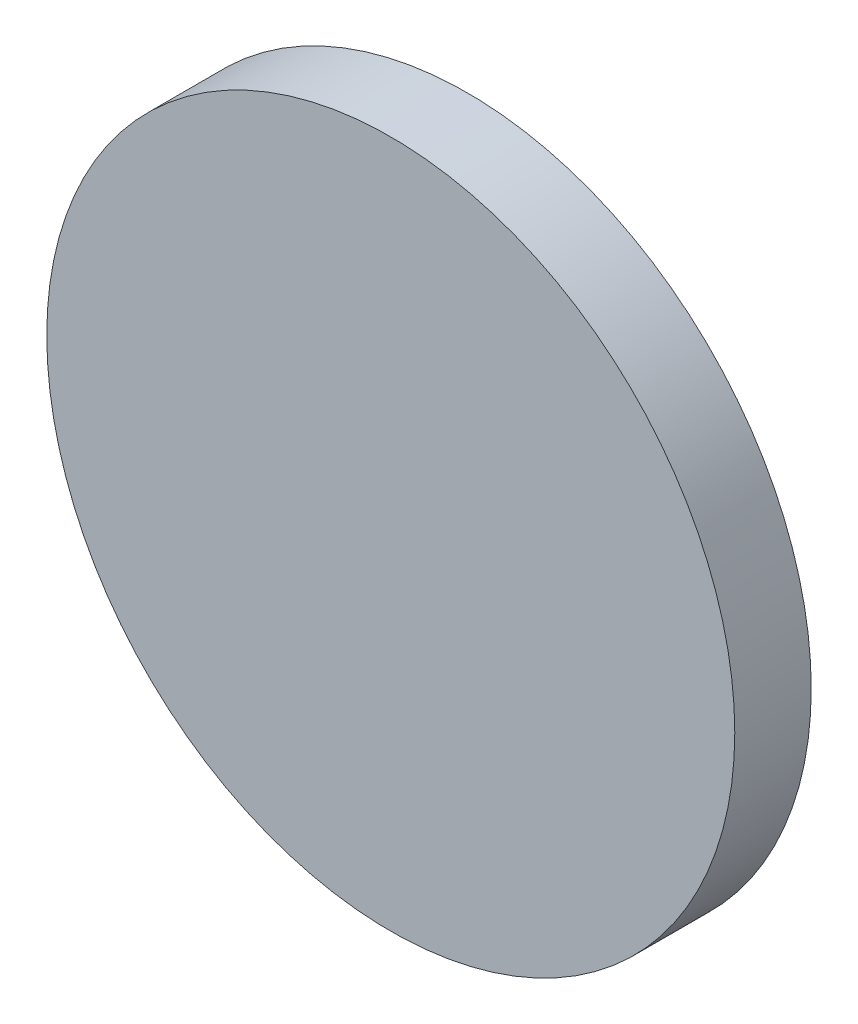
ISO-10303-21;
HEADER;
FILE_DESCRIPTION(('STEP AP214'),'2;1');
FILE_NAME('part.step','',(''),(''),'','','');
FILE_SCHEMA(('AUTOMOTIVE_DESIGN { 1 0 10303 214 1 1 1 1 }'));
ENDSEC;
DATA;
#1=APPLICATION_CONTEXT('core data for automotive mechanical design processes');
#2=APPLICATION_PROTOCOL_DEFINITION('international standard','automotive_design',2000,#1);
#3=PRODUCT_CONTEXT('',#1,'mechanical');
#4=PRODUCT('Part','Part','',(#3));
#5=PRODUCT_RELATED_PRODUCT_CATEGORY('part','',(#4));
#6=PRODUCT_DEFINITION_FORMATION('','',#4);
#7=PRODUCT_DEFINITION_CONTEXT('part definition',#1,'design');
#8=PRODUCT_DEFINITION('design','',#6,#7);
#9=PRODUCT_DEFINITION_SHAPE('','',#8);
#10=(LENGTH_UNIT() NAMED_UNIT(*) SI_UNIT(.MILLI.,.METRE.));
#11=(NAMED_UNIT(*) PLANE_ANGLE_UNIT() SI_UNIT($,.RADIAN.));
#12=(NAMED_UNIT(*) SI_UNIT($,.STERADIAN.) SOLID_ANGLE_UNIT());
#13=UNCERTAINTY_MEASURE_WITH_UNIT(LENGTH_MEASURE(1.E-05),#10,'distance_accuracy_value','');
#14=(GEOMETRIC_REPRESENTATION_CONTEXT(3) GLOBAL_UNCERTAINTY_ASSIGNED_CONTEXT((#13)) GLOBAL_UNIT_ASSIGNED_CONTEXT((#10,
#11,#12)) REPRESENTATION_CONTEXT('',''));
#15=CARTESIAN_POINT('',(0.,0.,0.));
#16=DIRECTION('',(0.,0.,1.));
#17=DIRECTION('',(1.,0.,0.));
#18=AXIS2_PLACEMENT_3D('',#15,#16,#17);
#19=CARTESIAN_POINT('',(0.,0.,2.));
#20=DIRECTION('',(0.,0.,-1.));
#21=DIRECTION('',(-1.,0.,0.));
#22=AXIS2_PLACEMENT_3D('',#19,#20,#21);
#23=CYLINDRICAL_SURFACE('',#22,9.);
#24=CARTESIAN_POINT('',(0.,0.,2.));
#25=DIRECTION('',(0.,0.,1.));
#26=DIRECTION('',(1.,0.,0.));
#27=AXIS2_PLACEMENT_3D('',#24,#25,#26);
#28=CIRCLE('',#27,9.);
#29=CARTESIAN_POINT('',(9.,0.,2.));
#30=VERTEX_POINT('',#29);
#31=EDGE_CURVE('E10',#30,#30,#28,.T.);
#32=ORIENTED_EDGE('',*,*,#31,.F.);
#33=EDGE_LOOP('',(#32));
#34=FACE_BOUND('',#33,.T.);
#35=CARTESIAN_POINT('',(0.,0.,0.));
#36=DIRECTION('',(0.,0.,1.));
#37=DIRECTION('',(1.,0.,0.));
#38=AXIS2_PLACEMENT_3D('',#35,#36,#37);
#39=CIRCLE('',#38,9.);
#40=CARTESIAN_POINT('',(9.,0.,0.));
#41=VERTEX_POINT('',#40);
#42=EDGE_CURVE('E40',#41,#41,#39,.T.);
#43=ORIENTED_EDGE('',*,*,#42,.T.);
#44=EDGE_LOOP('',(#43));
#45=FACE_BOUND('',#44,.T.);
#46=ADVANCED_FACE('F37',(#34,#45),#23,.T.);
#47=CARTESIAN_POINT('',(0.,0.,2.));
#48=DIRECTION('',(0.,0.,1.));
#49=DIRECTION('',(1.,0.,0.));
#50=AXIS2_PLACEMENT_3D('',#47,#48,#49);
#51=PLANE('',#50);
#52=ORIENTED_EDGE('',*,*,#31,.T.);
#53=EDGE_LOOP('',(#52));
#54=FACE_BOUND('',#53,.T.);
#55=ADVANCED_FACE('F54',(#54),#51,.T.);
#56=CARTESIAN_POINT('',(0.,0.,0.));
#57=DIRECTION('',(0.,0.,1.));
#58=DIRECTION('',(1.,0.,0.));
#59=AXIS2_PLACEMENT_3D('',#56,#57,#58);
#60=PLANE('',#59);
#61=ORIENTED_EDGE('',*,*,#42,.F.);
#62=EDGE_LOOP('',(#61));
#63=FACE_BOUND('',#62,.T.);
#64=ADVANCED_FACE('F52',(#63),#60,.F.);
#65=CLOSED_SHELL('',(#46,#55,#64));
#66=MANIFOLD_SOLID_BREP('B2',#65);
#67=ADVANCED_BREP_SHAPE_REPRESENTATION('',(#18,#66),#14);
#68=SHAPE_DEFINITION_REPRESENTATION(#9,#67);
ENDSEC;
END-ISO-10303-21;
